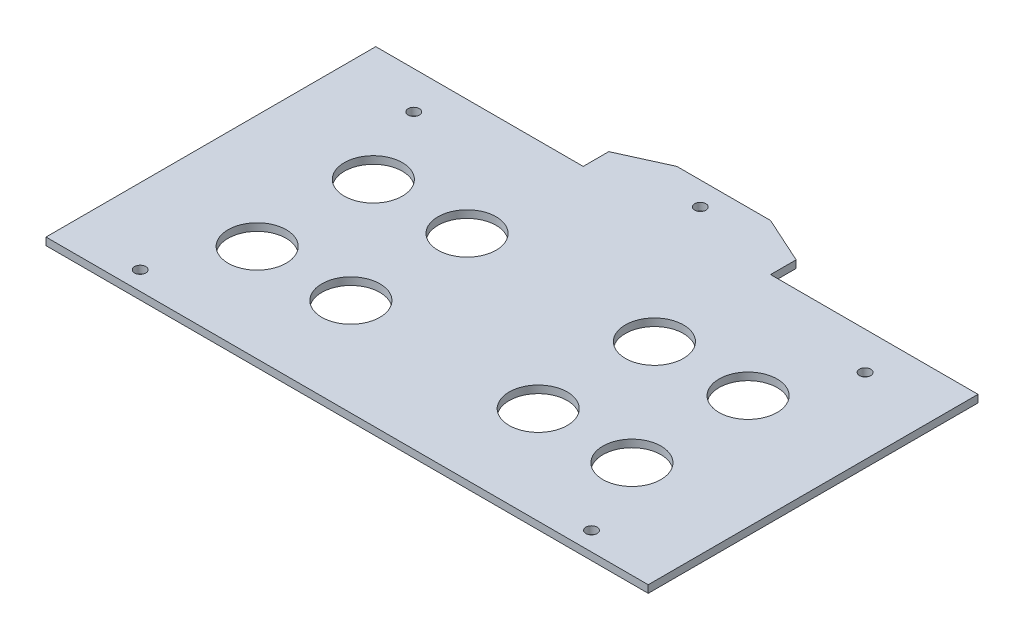
ISO-10303-21;
HEADER;
FILE_DESCRIPTION(('STEP AP214'),'2;1');
FILE_NAME('part.step','',(''),(''),'','','');
FILE_SCHEMA(('AUTOMOTIVE_DESIGN { 1 0 10303 214 1 1 1 1 }'));
ENDSEC;
DATA;
#1=APPLICATION_CONTEXT('core data for automotive mechanical design processes');
#2=APPLICATION_PROTOCOL_DEFINITION('international standard','automotive_design',2000,#1);
#3=PRODUCT_CONTEXT('',#1,'mechanical');
#4=PRODUCT('Part','Part','',(#3));
#5=PRODUCT_RELATED_PRODUCT_CATEGORY('part','',(#4));
#6=PRODUCT_DEFINITION_FORMATION('','',#4);
#7=PRODUCT_DEFINITION_CONTEXT('part definition',#1,'design');
#8=PRODUCT_DEFINITION('design','',#6,#7);
#9=PRODUCT_DEFINITION_SHAPE('','',#8);
#10=(LENGTH_UNIT() NAMED_UNIT(*) SI_UNIT(.MILLI.,.METRE.));
#11=(NAMED_UNIT(*) PLANE_ANGLE_UNIT() SI_UNIT($,.RADIAN.));
#12=(NAMED_UNIT(*) SI_UNIT($,.STERADIAN.) SOLID_ANGLE_UNIT());
#13=UNCERTAINTY_MEASURE_WITH_UNIT(LENGTH_MEASURE(1.E-05),#10,'distance_accuracy_value','');
#14=(GEOMETRIC_REPRESENTATION_CONTEXT(3) GLOBAL_UNCERTAINTY_ASSIGNED_CONTEXT((#13)) GLOBAL_UNIT_ASSIGNED_CONTEXT((#10,
#11,#12)) REPRESENTATION_CONTEXT('',''));
#15=CARTESIAN_POINT('',(0.,0.,0.));
#16=DIRECTION('',(0.,0.,1.));
#17=DIRECTION('',(1.,0.,0.));
#18=AXIS2_PLACEMENT_3D('',#15,#16,#17);
#19=CARTESIAN_POINT('',(0.,2.,-44.));
#20=DIRECTION('',(0.,0.,1.));
#21=DIRECTION('',(1.,0.,0.));
#22=AXIS2_PLACEMENT_3D('',#19,#20,#21);
#23=PLANE('',#22);
#24=DIRECTION('',(-1.,0.,0.));
#25=VECTOR('',#24,1.);
#26=CARTESIAN_POINT('',(0.,0.,-44.));
#27=LINE('',#26,#25);
#28=CARTESIAN_POINT('',(-23.8283042472908,0.,-44.));
#29=VERTEX_POINT('',#28);
#30=CARTESIAN_POINT('',(-79.1797078460986,0.,-44.));
#31=VERTEX_POINT('',#30);
#32=EDGE_CURVE('E158',#29,#31,#27,.T.);
#33=ORIENTED_EDGE('',*,*,#32,.T.);
#34=DIRECTION('',(0.,1.,0.));
#35=VECTOR('',#34,1.);
#36=CARTESIAN_POINT('',(-79.1797078460986,-8.,-44.));
#37=LINE('',#36,#35);
#38=CARTESIAN_POINT('',(-79.1797078460986,2.,-44.));
#39=VERTEX_POINT('',#38);
#40=EDGE_CURVE('E59',#31,#39,#37,.T.);
#41=ORIENTED_EDGE('',*,*,#40,.T.);
#42=DIRECTION('',(-1.,0.,0.));
#43=VECTOR('',#42,1.);
#44=CARTESIAN_POINT('',(0.,2.,-44.));
#45=LINE('',#44,#43);
#46=CARTESIAN_POINT('',(-23.8283042472908,2.,-44.));
#47=VERTEX_POINT('',#46);
#48=EDGE_CURVE('E135',#47,#39,#45,.T.);
#49=ORIENTED_EDGE('',*,*,#48,.F.);
#50=DIRECTION('',(0.,1.,0.));
#51=VECTOR('',#50,1.);
#52=CARTESIAN_POINT('',(-23.8283042472908,-51.537589944117,-44.));
#53=LINE('',#52,#51);
#54=EDGE_CURVE('E243',#29,#47,#53,.T.);
#55=ORIENTED_EDGE('',*,*,#54,.F.);
#56=EDGE_LOOP('',(#33,#41,#49,#55));
#57=FACE_BOUND('',#56,.T.);
#58=ADVANCED_FACE('F44',(#57),#23,.F.);
#59=CARTESIAN_POINT('',(81.523099351517,2.,-44.));
#60=VERTEX_POINT('',#59);
#61=CARTESIAN_POINT('',(26.1716957527092,2.,-44.));
#62=VERTEX_POINT('',#61);
#63=EDGE_CURVE('E139',#60,#62,#45,.T.);
#64=ORIENTED_EDGE('',*,*,#63,.F.);
#65=DIRECTION('',(0.,1.,0.));
#66=VECTOR('',#65,1.);
#67=CARTESIAN_POINT('',(81.523099351517,-8.,-44.));
#68=LINE('',#67,#66);
#69=CARTESIAN_POINT('',(81.523099351517,0.,-44.));
#70=VERTEX_POINT('',#69);
#71=EDGE_CURVE('E203',#70,#60,#68,.T.);
#72=ORIENTED_EDGE('',*,*,#71,.F.);
#73=CARTESIAN_POINT('',(26.1716957527092,0.,-44.));
#74=VERTEX_POINT('',#73);
#75=EDGE_CURVE('E155',#70,#74,#27,.T.);
#76=ORIENTED_EDGE('',*,*,#75,.T.);
#77=DIRECTION('',(0.,1.,0.));
#78=VECTOR('',#77,1.);
#79=CARTESIAN_POINT('',(26.1716957527092,-51.537589944117,-44.));
#80=LINE('',#79,#78);
#81=EDGE_CURVE('E219',#74,#62,#80,.T.);
#82=ORIENTED_EDGE('',*,*,#81,.T.);
#83=EDGE_LOOP('',(#64,#72,#76,#82));
#84=FACE_BOUND('',#83,.T.);
#85=ADVANCED_FACE('F46',(#84),#23,.F.);
#86=CARTESIAN_POINT('',(-59.0420655328614,2.,-34.));
#87=DIRECTION('',(0.,-1.,0.));
#88=DIRECTION('',(0.,0.,-1.));
#89=AXIS2_PLACEMENT_3D('',#86,#87,#88);
#90=CYLINDRICAL_SURFACE('',#89,1.5);
#91=CARTESIAN_POINT('',(-59.0420655328614,2.,-34.));
#92=DIRECTION('',(0.,1.,0.));
#93=DIRECTION('',(0.,0.,1.));
#94=AXIS2_PLACEMENT_3D('',#91,#92,#93);
#95=CIRCLE('',#94,1.5);
#96=CARTESIAN_POINT('',(-59.0420655328614,2.,-32.5));
#97=VERTEX_POINT('',#96);
#98=EDGE_CURVE('E149',#97,#97,#95,.T.);
#99=ORIENTED_EDGE('',*,*,#98,.T.);
#100=EDGE_LOOP('',(#99));
#101=FACE_BOUND('',#100,.T.);
#102=CARTESIAN_POINT('',(-59.0420655328614,0.,-34.));
#103=DIRECTION('',(0.,1.,0.));
#104=DIRECTION('',(0.,0.,1.));
#105=AXIS2_PLACEMENT_3D('',#102,#103,#104);
#106=CIRCLE('',#105,1.5);
#107=CARTESIAN_POINT('',(-59.0420655328614,0.,-32.5));
#108=VERTEX_POINT('',#107);
#109=EDGE_CURVE('E166',#108,#108,#106,.T.);
#110=ORIENTED_EDGE('',*,*,#109,.F.);
#111=EDGE_LOOP('',(#110));
#112=FACE_BOUND('',#111,.T.);
#113=ADVANCED_FACE('F314',(#101,#112),#90,.F.);
#114=CARTESIAN_POINT('',(-59.0420655328614,2.,39.));
#115=DIRECTION('',(0.,-1.,0.));
#116=DIRECTION('',(0.,0.,-1.));
#117=AXIS2_PLACEMENT_3D('',#114,#115,#116);
#118=CYLINDRICAL_SURFACE('',#117,1.5);
#119=CARTESIAN_POINT('',(-59.0420655328614,2.,39.));
#120=DIRECTION('',(0.,1.,0.));
#121=DIRECTION('',(0.,0.,1.));
#122=AXIS2_PLACEMENT_3D('',#119,#120,#121);
#123=CIRCLE('',#122,1.5);
#124=CARTESIAN_POINT('',(-59.0420655328614,2.,40.5));
#125=VERTEX_POINT('',#124);
#126=EDGE_CURVE('E142',#125,#125,#123,.T.);
#127=ORIENTED_EDGE('',*,*,#126,.T.);
#128=EDGE_LOOP('',(#127));
#129=FACE_BOUND('',#128,.T.);
#130=CARTESIAN_POINT('',(-59.0420655328614,0.,39.));
#131=DIRECTION('',(0.,1.,0.));
#132=DIRECTION('',(0.,0.,1.));
#133=AXIS2_PLACEMENT_3D('',#130,#131,#132);
#134=CIRCLE('',#133,1.5);
#135=CARTESIAN_POINT('',(-59.0420655328614,0.,40.5));
#136=VERTEX_POINT('',#135);
#137=EDGE_CURVE('E163',#136,#136,#134,.T.);
#138=ORIENTED_EDGE('',*,*,#137,.F.);
#139=EDGE_LOOP('',(#138));
#140=FACE_BOUND('',#139,.T.);
#141=ADVANCED_FACE('F385',(#129,#140),#118,.F.);
#142=CARTESIAN_POINT('',(61.3854570382798,2.,39.));
#143=DIRECTION('',(0.,-1.,0.));
#144=DIRECTION('',(0.,0.,-1.));
#145=AXIS2_PLACEMENT_3D('',#142,#143,#144);
#146=CYLINDRICAL_SURFACE('',#145,1.5);
#147=CARTESIAN_POINT('',(61.3854570382798,2.,39.));
#148=DIRECTION('',(0.,1.,0.));
#149=DIRECTION('',(0.,0.,1.));
#150=AXIS2_PLACEMENT_3D('',#147,#148,#149);
#151=CIRCLE('',#150,1.5);
#152=CARTESIAN_POINT('',(61.3854570382798,2.,40.5));
#153=VERTEX_POINT('',#152);
#154=EDGE_CURVE('E138',#153,#153,#151,.T.);
#155=ORIENTED_EDGE('',*,*,#154,.T.);
#156=EDGE_LOOP('',(#155));
#157=FACE_BOUND('',#156,.T.);
#158=CARTESIAN_POINT('',(61.3854570382798,0.,39.));
#159=DIRECTION('',(0.,1.,0.));
#160=DIRECTION('',(0.,0.,1.));
#161=AXIS2_PLACEMENT_3D('',#158,#159,#160);
#162=CIRCLE('',#161,1.5);
#163=CARTESIAN_POINT('',(61.3854570382798,0.,40.5));
#164=VERTEX_POINT('',#163);
#165=EDGE_CURVE('E160',#164,#164,#162,.T.);
#166=ORIENTED_EDGE('',*,*,#165,.F.);
#167=EDGE_LOOP('',(#166));
#168=FACE_BOUND('',#167,.T.);
#169=ADVANCED_FACE('F389',(#157,#168),#146,.F.);
#170=CARTESIAN_POINT('',(0.,2.,44.));
#171=DIRECTION('',(0.,0.,-1.));
#172=DIRECTION('',(-1.,0.,0.));
#173=AXIS2_PLACEMENT_3D('',#170,#171,#172);
#174=PLANE('',#173);
#175=DIRECTION('',(1.,0.,0.));
#176=VECTOR('',#175,1.);
#177=CARTESIAN_POINT('',(0.,2.,44.));
#178=LINE('',#177,#176);
#179=CARTESIAN_POINT('',(-79.1797078460986,2.,44.));
#180=VERTEX_POINT('',#179);
#181=CARTESIAN_POINT('',(81.523099351517,2.,44.));
#182=VERTEX_POINT('',#181);
#183=EDGE_CURVE('E133',#180,#182,#178,.T.);
#184=ORIENTED_EDGE('',*,*,#183,.F.);
#185=DIRECTION('',(0.,1.,0.));
#186=VECTOR('',#185,1.);
#187=CARTESIAN_POINT('',(-79.1797078460986,-8.,44.));
#188=LINE('',#187,#186);
#189=CARTESIAN_POINT('',(-79.1797078460986,0.,44.));
#190=VERTEX_POINT('',#189);
#191=EDGE_CURVE('E118',#190,#180,#188,.T.);
#192=ORIENTED_EDGE('',*,*,#191,.F.);
#193=DIRECTION('',(1.,0.,0.));
#194=VECTOR('',#193,1.);
#195=CARTESIAN_POINT('',(0.,0.,44.));
#196=LINE('',#195,#194);
#197=CARTESIAN_POINT('',(81.523099351517,0.,44.));
#198=VERTEX_POINT('',#197);
#199=EDGE_CURVE('E157',#190,#198,#196,.T.);
#200=ORIENTED_EDGE('',*,*,#199,.T.);
#201=DIRECTION('',(0.,1.,0.));
#202=VECTOR('',#201,1.);
#203=CARTESIAN_POINT('',(81.523099351517,-8.,44.));
#204=LINE('',#203,#202);
#205=EDGE_CURVE('E66',#198,#182,#204,.T.);
#206=ORIENTED_EDGE('',*,*,#205,.T.);
#207=EDGE_LOOP('',(#184,#192,#200,#206));
#208=FACE_BOUND('',#207,.T.);
#209=ADVANCED_FACE('F137',(#208),#174,.F.);
#210=CARTESIAN_POINT('',(61.3854570382798,2.,-34.));
#211=DIRECTION('',(0.,-1.,0.));
#212=DIRECTION('',(0.,0.,-1.));
#213=AXIS2_PLACEMENT_3D('',#210,#211,#212);
#214=CYLINDRICAL_SURFACE('',#213,1.5);
#215=CARTESIAN_POINT('',(61.3854570382798,2.,-34.));
#216=DIRECTION('',(0.,1.,0.));
#217=DIRECTION('',(0.,0.,1.));
#218=AXIS2_PLACEMENT_3D('',#215,#216,#217);
#219=CIRCLE('',#218,1.5);
#220=CARTESIAN_POINT('',(61.3854570382798,2.,-32.5));
#221=VERTEX_POINT('',#220);
#222=EDGE_CURVE('E152',#221,#221,#219,.T.);
#223=ORIENTED_EDGE('',*,*,#222,.T.);
#224=EDGE_LOOP('',(#223));
#225=FACE_BOUND('',#224,.T.);
#226=CARTESIAN_POINT('',(61.3854570382798,0.,-34.));
#227=DIRECTION('',(0.,1.,0.));
#228=DIRECTION('',(0.,0.,1.));
#229=AXIS2_PLACEMENT_3D('',#226,#227,#228);
#230=CIRCLE('',#229,1.5);
#231=CARTESIAN_POINT('',(61.3854570382798,0.,-32.5));
#232=VERTEX_POINT('',#231);
#233=EDGE_CURVE('E169',#232,#232,#230,.T.);
#234=ORIENTED_EDGE('',*,*,#233,.F.);
#235=EDGE_LOOP('',(#234));
#236=FACE_BOUND('',#235,.T.);
#237=ADVANCED_FACE('F283',(#225,#236),#214,.F.);
#238=CARTESIAN_POINT('',(0.,2.,0.));
#239=DIRECTION('',(0.,1.,0.));
#240=DIRECTION('',(0.,0.,1.));
#241=AXIS2_PLACEMENT_3D('',#238,#239,#240);
#242=PLANE('',#241);
#243=DIRECTION('',(0.,0.,-1.));
#244=VECTOR('',#243,1.);
#245=CARTESIAN_POINT('',(-79.1797078460986,2.,-44.));
#246=LINE('',#245,#244);
#247=EDGE_CURVE('E121',#180,#39,#246,.T.);
#248=ORIENTED_EDGE('',*,*,#247,.F.);
#249=ORIENTED_EDGE('',*,*,#183,.T.);
#250=DIRECTION('',(0.,0.,1.));
#251=VECTOR('',#250,1.);
#252=CARTESIAN_POINT('',(81.523099351517,2.,-44.));
#253=LINE('',#252,#251);
#254=EDGE_CURVE('E207',#60,#182,#253,.T.);
#255=ORIENTED_EDGE('',*,*,#254,.F.);
#256=ORIENTED_EDGE('',*,*,#63,.T.);
#257=DIRECTION('',(0.,0.,-1.));
#258=VECTOR('',#257,1.);
#259=CARTESIAN_POINT('',(26.1716957527092,2.,-44.));
#260=LINE('',#259,#258);
#261=CARTESIAN_POINT('',(26.1716957527092,2.,-50.823606938333));
#262=VERTEX_POINT('',#261);
#263=EDGE_CURVE('E227',#62,#262,#260,.T.);
#264=ORIENTED_EDGE('',*,*,#263,.T.);
#265=DIRECTION('',(-0.910654396943774,0.,-0.41316893557838));
#266=VECTOR('',#265,1.);
#267=CARTESIAN_POINT('',(26.1716957527092,2.,-50.823606938333));
#268=LINE('',#267,#266);
#269=CARTESIAN_POINT('',(13.6716957527092,2.,-56.4949260601234));
#270=VERTEX_POINT('',#269);
#271=EDGE_CURVE('E230',#262,#270,#268,.T.);
#272=ORIENTED_EDGE('',*,*,#271,.T.);
#273=DIRECTION('',(-1.,0.,0.));
#274=VECTOR('',#273,1.);
#275=CARTESIAN_POINT('',(13.6716957527092,2.,-56.4949260601234));
#276=LINE('',#275,#274);
#277=CARTESIAN_POINT('',(-11.3283042472908,2.,-56.4949260601234));
#278=VERTEX_POINT('',#277);
#279=EDGE_CURVE('E233',#270,#278,#276,.T.);
#280=ORIENTED_EDGE('',*,*,#279,.T.);
#281=DIRECTION('',(-0.910654396943774,0.,0.41316893557838));
#282=VECTOR('',#281,1.);
#283=CARTESIAN_POINT('',(-11.3283042472908,2.,-56.4949260601234));
#284=LINE('',#283,#282);
#285=CARTESIAN_POINT('',(-23.8283042472908,2.,-50.823606938333));
#286=VERTEX_POINT('',#285);
#287=EDGE_CURVE('E236',#278,#286,#284,.T.);
#288=ORIENTED_EDGE('',*,*,#287,.T.);
#289=DIRECTION('',(0.,0.,1.));
#290=VECTOR('',#289,1.);
#291=CARTESIAN_POINT('',(-23.8283042472908,2.,-50.823606938333));
#292=LINE('',#291,#290);
#293=EDGE_CURVE('E239',#286,#47,#292,.T.);
#294=ORIENTED_EDGE('',*,*,#293,.T.);
#295=ORIENTED_EDGE('',*,*,#48,.T.);
#296=EDGE_LOOP('',(#248,#249,#255,#256,#264,#272,#280,#288,#294,#295));
#297=FACE_BOUND('',#296,.T.);
#298=CARTESIAN_POINT('',(-23.8283042472908,2.,18.0000000000002));
#299=DIRECTION('',(0.,1.,0.));
#300=DIRECTION('',(0.,0.,-1.));
#301=AXIS2_PLACEMENT_3D('',#298,#299,#300);
#302=CIRCLE('',#301,7.75);
#303=CARTESIAN_POINT('',(-23.8283042472908,2.,10.2500000000002));
#304=VERTEX_POINT('',#303);
#305=EDGE_CURVE('E268',#304,#304,#302,.T.);
#306=ORIENTED_EDGE('',*,*,#305,.F.);
#307=EDGE_LOOP('',(#306));
#308=FACE_BOUND('',#307,.T.);
#309=CARTESIAN_POINT('',(51.1716957527092,2.,18.0000000000004));
#310=DIRECTION('',(0.,1.,0.));
#311=DIRECTION('',(0.,0.,-1.));
#312=AXIS2_PLACEMENT_3D('',#309,#310,#311);
#313=CIRCLE('',#312,7.75);
#314=CARTESIAN_POINT('',(51.1716957527092,2.,10.2500000000004));
#315=VERTEX_POINT('',#314);
#316=EDGE_CURVE('E271',#315,#315,#313,.T.);
#317=ORIENTED_EDGE('',*,*,#316,.F.);
#318=EDGE_LOOP('',(#317));
#319=FACE_BOUND('',#318,.T.);
#320=CARTESIAN_POINT('',(26.1716957527092,2.,18.0000000000004));
#321=DIRECTION('',(0.,1.,0.));
#322=DIRECTION('',(0.,0.,-1.));
#323=AXIS2_PLACEMENT_3D('',#320,#321,#322);
#324=CIRCLE('',#323,7.75);
#325=CARTESIAN_POINT('',(26.1716957527092,2.,10.2500000000004));
#326=VERTEX_POINT('',#325);
#327=EDGE_CURVE('E255',#326,#326,#324,.T.);
#328=ORIENTED_EDGE('',*,*,#327,.F.);
#329=EDGE_LOOP('',(#328));
#330=FACE_BOUND('',#329,.T.);
#331=CARTESIAN_POINT('',(-48.8283042472908,2.,-13.));
#332=DIRECTION('',(0.,1.,0.));
#333=DIRECTION('',(0.,0.,1.));
#334=AXIS2_PLACEMENT_3D('',#331,#332,#333);
#335=CIRCLE('',#334,7.75);
#336=CARTESIAN_POINT('',(-48.8283042472908,2.,-5.25));
#337=VERTEX_POINT('',#336);
#338=EDGE_CURVE('E265',#337,#337,#335,.T.);
#339=ORIENTED_EDGE('',*,*,#338,.F.);
#340=EDGE_LOOP('',(#339));
#341=FACE_BOUND('',#340,.T.);
#342=CARTESIAN_POINT('',(-23.8283042472908,2.,-13.0000000000002));
#343=DIRECTION('',(0.,1.,0.));
#344=DIRECTION('',(0.,0.,1.));
#345=AXIS2_PLACEMENT_3D('',#342,#343,#344);
#346=CIRCLE('',#345,7.75);
#347=CARTESIAN_POINT('',(-23.8283042472908,2.,-5.25000000000018));
#348=VERTEX_POINT('',#347);
#349=EDGE_CURVE('E262',#348,#348,#346,.T.);
#350=ORIENTED_EDGE('',*,*,#349,.F.);
#351=EDGE_LOOP('',(#350));
#352=FACE_BOUND('',#351,.T.);
#353=CARTESIAN_POINT('',(51.1716957527092,2.,-13.0000000000003));
#354=DIRECTION('',(0.,1.,0.));
#355=DIRECTION('',(0.,0.,1.));
#356=AXIS2_PLACEMENT_3D('',#353,#354,#355);
#357=CIRCLE('',#356,7.75);
#358=CARTESIAN_POINT('',(51.1716957527092,2.,-5.25000000000035));
#359=VERTEX_POINT('',#358);
#360=EDGE_CURVE('E259',#359,#359,#357,.T.);
#361=ORIENTED_EDGE('',*,*,#360,.F.);
#362=EDGE_LOOP('',(#361));
#363=FACE_BOUND('',#362,.T.);
#364=CARTESIAN_POINT('',(26.1716957527092,2.,-13.0000000000003));
#365=DIRECTION('',(0.,1.,0.));
#366=DIRECTION('',(0.,0.,1.));
#367=AXIS2_PLACEMENT_3D('',#364,#365,#366);
#368=CIRCLE('',#367,7.75);
#369=CARTESIAN_POINT('',(26.1716957527092,2.,-5.25000000000035));
#370=VERTEX_POINT('',#369);
#371=EDGE_CURVE('E256',#370,#370,#368,.T.);
#372=ORIENTED_EDGE('',*,*,#371,.F.);
#373=EDGE_LOOP('',(#372));
#374=FACE_BOUND('',#373,.T.);
#375=CARTESIAN_POINT('',(-48.8283042472908,2.,18.));
#376=DIRECTION('',(0.,1.,0.));
#377=DIRECTION('',(0.,0.,-1.));
#378=AXIS2_PLACEMENT_3D('',#375,#376,#377);
#379=CIRCLE('',#378,7.75);
#380=CARTESIAN_POINT('',(-48.8283042472908,2.,10.25));
#381=VERTEX_POINT('',#380);
#382=EDGE_CURVE('E176',#381,#381,#379,.T.);
#383=ORIENTED_EDGE('',*,*,#382,.F.);
#384=EDGE_LOOP('',(#383));
#385=FACE_BOUND('',#384,.T.);
#386=ORIENTED_EDGE('',*,*,#154,.F.);
#387=EDGE_LOOP('',(#386));
#388=FACE_BOUND('',#387,.T.);
#389=ORIENTED_EDGE('',*,*,#126,.F.);
#390=EDGE_LOOP('',(#389));
#391=FACE_BOUND('',#390,.T.);
#392=ORIENTED_EDGE('',*,*,#98,.F.);
#393=EDGE_LOOP('',(#392));
#394=FACE_BOUND('',#393,.T.);
#395=ORIENTED_EDGE('',*,*,#222,.F.);
#396=EDGE_LOOP('',(#395));
#397=FACE_BOUND('',#396,.T.);
#398=CARTESIAN_POINT('',(1.1716957527092,2.,-50.2474630300617));
#399=DIRECTION('',(0.,1.,0.));
#400=DIRECTION('',(0.,0.,1.));
#401=AXIS2_PLACEMENT_3D('',#398,#399,#400);
#402=CIRCLE('',#401,1.5);
#403=CARTESIAN_POINT('',(1.1716957527092,2.,-48.7474630300617));
#404=VERTEX_POINT('',#403);
#405=EDGE_CURVE('E224',#404,#404,#402,.T.);
#406=ORIENTED_EDGE('',*,*,#405,.F.);
#407=EDGE_LOOP('',(#406));
#408=FACE_BOUND('',#407,.T.);
#409=ADVANCED_FACE('F130',(#297,#308,#319,#330,#341,#352,#363,#374,#385,#388,#391,#394,#397,
#408),#242,.T.);
#410=CARTESIAN_POINT('',(0.,0.,0.));
#411=DIRECTION('',(0.,1.,0.));
#412=DIRECTION('',(0.,0.,1.));
#413=AXIS2_PLACEMENT_3D('',#410,#411,#412);
#414=PLANE('',#413);
#415=CARTESIAN_POINT('',(-23.8283042472908,0.,18.0000000000002));
#416=DIRECTION('',(0.,1.,0.));
#417=DIRECTION('',(0.,0.,1.));
#418=AXIS2_PLACEMENT_3D('',#415,#416,#417);
#419=CIRCLE('',#418,7.75);
#420=CARTESIAN_POINT('',(-23.8283042472908,0.,25.7500000000002));
#421=VERTEX_POINT('',#420);
#422=EDGE_CURVE('E194',#421,#421,#419,.T.);
#423=ORIENTED_EDGE('',*,*,#422,.T.);
#424=EDGE_LOOP('',(#423));
#425=FACE_BOUND('',#424,.T.);
#426=CARTESIAN_POINT('',(51.1716957527092,0.,18.0000000000004));
#427=DIRECTION('',(0.,1.,0.));
#428=DIRECTION('',(0.,0.,1.));
#429=AXIS2_PLACEMENT_3D('',#426,#427,#428);
#430=CIRCLE('',#429,7.75);
#431=CARTESIAN_POINT('',(51.1716957527092,0.,25.7500000000004));
#432=VERTEX_POINT('',#431);
#433=EDGE_CURVE('E191',#432,#432,#430,.T.);
#434=ORIENTED_EDGE('',*,*,#433,.T.);
#435=EDGE_LOOP('',(#434));
#436=FACE_BOUND('',#435,.T.);
#437=CARTESIAN_POINT('',(26.1716957527092,0.,18.0000000000004));
#438=DIRECTION('',(0.,1.,0.));
#439=DIRECTION('',(0.,0.,1.));
#440=AXIS2_PLACEMENT_3D('',#437,#438,#439);
#441=CIRCLE('',#440,7.75);
#442=CARTESIAN_POINT('',(26.1716957527092,0.,25.7500000000004));
#443=VERTEX_POINT('',#442);
#444=EDGE_CURVE('E188',#443,#443,#441,.T.);
#445=ORIENTED_EDGE('',*,*,#444,.T.);
#446=EDGE_LOOP('',(#445));
#447=FACE_BOUND('',#446,.T.);
#448=CARTESIAN_POINT('',(-48.8283042472908,0.,-13.));
#449=DIRECTION('',(0.,1.,0.));
#450=DIRECTION('',(0.,0.,1.));
#451=AXIS2_PLACEMENT_3D('',#448,#449,#450);
#452=CIRCLE('',#451,7.75);
#453=CARTESIAN_POINT('',(-48.8283042472908,0.,-5.25));
#454=VERTEX_POINT('',#453);
#455=EDGE_CURVE('E185',#454,#454,#452,.T.);
#456=ORIENTED_EDGE('',*,*,#455,.T.);
#457=EDGE_LOOP('',(#456));
#458=FACE_BOUND('',#457,.T.);
#459=CARTESIAN_POINT('',(-23.8283042472908,0.,-13.0000000000002));
#460=DIRECTION('',(0.,1.,0.));
#461=DIRECTION('',(0.,0.,1.));
#462=AXIS2_PLACEMENT_3D('',#459,#460,#461);
#463=CIRCLE('',#462,7.75);
#464=CARTESIAN_POINT('',(-23.8283042472908,0.,-5.25000000000018));
#465=VERTEX_POINT('',#464);
#466=EDGE_CURVE('E182',#465,#465,#463,.T.);
#467=ORIENTED_EDGE('',*,*,#466,.T.);
#468=EDGE_LOOP('',(#467));
#469=FACE_BOUND('',#468,.T.);
#470=CARTESIAN_POINT('',(51.1716957527092,0.,-13.0000000000003));
#471=DIRECTION('',(0.,1.,0.));
#472=DIRECTION('',(0.,0.,1.));
#473=AXIS2_PLACEMENT_3D('',#470,#471,#472);
#474=CIRCLE('',#473,7.75);
#475=CARTESIAN_POINT('',(51.1716957527092,0.,-5.25000000000035));
#476=VERTEX_POINT('',#475);
#477=EDGE_CURVE('E179',#476,#476,#474,.T.);
#478=ORIENTED_EDGE('',*,*,#477,.T.);
#479=EDGE_LOOP('',(#478));
#480=FACE_BOUND('',#479,.T.);
#481=CARTESIAN_POINT('',(26.1716957527092,0.,-13.0000000000003));
#482=DIRECTION('',(0.,1.,0.));
#483=DIRECTION('',(0.,0.,1.));
#484=AXIS2_PLACEMENT_3D('',#481,#482,#483);
#485=CIRCLE('',#484,7.75);
#486=CARTESIAN_POINT('',(26.1716957527092,0.,-5.25000000000035));
#487=VERTEX_POINT('',#486);
#488=EDGE_CURVE('E175',#487,#487,#485,.T.);
#489=ORIENTED_EDGE('',*,*,#488,.T.);
#490=EDGE_LOOP('',(#489));
#491=FACE_BOUND('',#490,.T.);
#492=CARTESIAN_POINT('',(-48.8283042472908,0.,18.));
#493=DIRECTION('',(0.,1.,0.));
#494=DIRECTION('',(0.,0.,1.));
#495=AXIS2_PLACEMENT_3D('',#492,#493,#494);
#496=CIRCLE('',#495,7.75);
#497=CARTESIAN_POINT('',(-48.8283042472908,0.,25.75));
#498=VERTEX_POINT('',#497);
#499=EDGE_CURVE('E172',#498,#498,#496,.T.);
#500=ORIENTED_EDGE('',*,*,#499,.T.);
#501=EDGE_LOOP('',(#500));
#502=FACE_BOUND('',#501,.T.);
#503=ORIENTED_EDGE('',*,*,#199,.F.);
#504=DIRECTION('',(0.,0.,-1.));
#505=VECTOR('',#504,1.);
#506=CARTESIAN_POINT('',(-79.1797078460986,0.,0.));
#507=LINE('',#506,#505);
#508=EDGE_CURVE('E11',#190,#31,#507,.T.);
#509=ORIENTED_EDGE('',*,*,#508,.T.);
#510=ORIENTED_EDGE('',*,*,#32,.F.);
#511=DIRECTION('',(0.,0.,-1.));
#512=VECTOR('',#511,1.);
#513=CARTESIAN_POINT('',(-23.8283042472908,0.,-50.823606938333));
#514=LINE('',#513,#512);
#515=CARTESIAN_POINT('',(-23.8283042472908,0.,-50.823606938333));
#516=VERTEX_POINT('',#515);
#517=EDGE_CURVE('E221',#29,#516,#514,.T.);
#518=ORIENTED_EDGE('',*,*,#517,.T.);
#519=DIRECTION('',(0.910654396943774,0.,-0.41316893557838));
#520=VECTOR('',#519,1.);
#521=CARTESIAN_POINT('',(-11.3283042472908,0.,-56.4949260601234));
#522=LINE('',#521,#520);
#523=CARTESIAN_POINT('',(-11.3283042472908,0.,-56.4949260601234));
#524=VERTEX_POINT('',#523);
#525=EDGE_CURVE('E218',#516,#524,#522,.T.);
#526=ORIENTED_EDGE('',*,*,#525,.T.);
#527=DIRECTION('',(1.,0.,0.));
#528=VECTOR('',#527,1.);
#529=CARTESIAN_POINT('',(13.6716957527092,0.,-56.4949260601234));
#530=LINE('',#529,#528);
#531=CARTESIAN_POINT('',(13.6716957527092,0.,-56.4949260601234));
#532=VERTEX_POINT('',#531);
#533=EDGE_CURVE('E216',#524,#532,#530,.T.);
#534=ORIENTED_EDGE('',*,*,#533,.T.);
#535=DIRECTION('',(0.910654396943774,0.,0.41316893557838));
#536=VECTOR('',#535,1.);
#537=CARTESIAN_POINT('',(26.1716957527092,0.,-50.823606938333));
#538=LINE('',#537,#536);
#539=CARTESIAN_POINT('',(26.1716957527092,0.,-50.823606938333));
#540=VERTEX_POINT('',#539);
#541=EDGE_CURVE('E212',#532,#540,#538,.T.);
#542=ORIENTED_EDGE('',*,*,#541,.T.);
#543=DIRECTION('',(0.,0.,1.));
#544=VECTOR('',#543,1.);
#545=CARTESIAN_POINT('',(26.1716957527092,0.,-44.));
#546=LINE('',#545,#544);
#547=EDGE_CURVE('E215',#540,#74,#546,.T.);
#548=ORIENTED_EDGE('',*,*,#547,.T.);
#549=ORIENTED_EDGE('',*,*,#75,.F.);
#550=DIRECTION('',(0.,0.,1.));
#551=VECTOR('',#550,1.);
#552=CARTESIAN_POINT('',(81.523099351517,0.,0.));
#553=LINE('',#552,#551);
#554=EDGE_CURVE('E52',#70,#198,#553,.T.);
#555=ORIENTED_EDGE('',*,*,#554,.T.);
#556=EDGE_LOOP('',(#503,#509,#510,#518,#526,#534,#542,#548,#549,#555));
#557=FACE_BOUND('',#556,.T.);
#558=ORIENTED_EDGE('',*,*,#165,.T.);
#559=EDGE_LOOP('',(#558));
#560=FACE_BOUND('',#559,.T.);
#561=ORIENTED_EDGE('',*,*,#137,.T.);
#562=EDGE_LOOP('',(#561));
#563=FACE_BOUND('',#562,.T.);
#564=ORIENTED_EDGE('',*,*,#109,.T.);
#565=EDGE_LOOP('',(#564));
#566=FACE_BOUND('',#565,.T.);
#567=ORIENTED_EDGE('',*,*,#233,.T.);
#568=EDGE_LOOP('',(#567));
#569=FACE_BOUND('',#568,.T.);
#570=CARTESIAN_POINT('',(1.1716957527092,0.,-50.2474630300617));
#571=DIRECTION('',(0.,1.,0.));
#572=DIRECTION('',(0.,0.,1.));
#573=AXIS2_PLACEMENT_3D('',#570,#571,#572);
#574=CIRCLE('',#573,1.5);
#575=CARTESIAN_POINT('',(1.1716957527092,0.,-48.7474630300617));
#576=VERTEX_POINT('',#575);
#577=EDGE_CURVE('E214',#576,#576,#574,.F.);
#578=ORIENTED_EDGE('',*,*,#577,.F.);
#579=EDGE_LOOP('',(#578));
#580=FACE_BOUND('',#579,.T.);
#581=ADVANCED_FACE('F198',(#425,#436,#447,#458,#469,#480,#491,#502,#557,#560,#563,#566,#569,
#580),#414,.F.);
#582=CARTESIAN_POINT('',(-48.8283042472908,-8.,18.));
#583=DIRECTION('',(0.,1.,0.));
#584=DIRECTION('',(0.,0.,1.));
#585=AXIS2_PLACEMENT_3D('',#582,#583,#584);
#586=CYLINDRICAL_SURFACE('',#585,7.75);
#587=ORIENTED_EDGE('',*,*,#382,.T.);
#588=EDGE_LOOP('',(#587));
#589=FACE_BOUND('',#588,.T.);
#590=ORIENTED_EDGE('',*,*,#499,.F.);
#591=EDGE_LOOP('',(#590));
#592=FACE_BOUND('',#591,.T.);
#593=ADVANCED_FACE('F278',(#589,#592),#586,.F.);
#594=CARTESIAN_POINT('',(26.1716957527092,-8.,-13.0000000000003));
#595=DIRECTION('',(0.,1.,0.));
#596=DIRECTION('',(0.,0.,1.));
#597=AXIS2_PLACEMENT_3D('',#594,#595,#596);
#598=CYLINDRICAL_SURFACE('',#597,7.75);
#599=ORIENTED_EDGE('',*,*,#371,.T.);
#600=EDGE_LOOP('',(#599));
#601=FACE_BOUND('',#600,.T.);
#602=ORIENTED_EDGE('',*,*,#488,.F.);
#603=EDGE_LOOP('',(#602));
#604=FACE_BOUND('',#603,.T.);
#605=ADVANCED_FACE('F352',(#601,#604),#598,.F.);
#606=CARTESIAN_POINT('',(51.1716957527092,-8.,-13.0000000000003));
#607=DIRECTION('',(0.,1.,0.));
#608=DIRECTION('',(0.,0.,1.));
#609=AXIS2_PLACEMENT_3D('',#606,#607,#608);
#610=CYLINDRICAL_SURFACE('',#609,7.75);
#611=ORIENTED_EDGE('',*,*,#360,.T.);
#612=EDGE_LOOP('',(#611));
#613=FACE_BOUND('',#612,.T.);
#614=ORIENTED_EDGE('',*,*,#477,.F.);
#615=EDGE_LOOP('',(#614));
#616=FACE_BOUND('',#615,.T.);
#617=ADVANCED_FACE('F355',(#613,#616),#610,.F.);
#618=CARTESIAN_POINT('',(-23.8283042472908,-8.,-13.0000000000002));
#619=DIRECTION('',(0.,1.,0.));
#620=DIRECTION('',(0.,0.,1.));
#621=AXIS2_PLACEMENT_3D('',#618,#619,#620);
#622=CYLINDRICAL_SURFACE('',#621,7.75);
#623=ORIENTED_EDGE('',*,*,#349,.T.);
#624=EDGE_LOOP('',(#623));
#625=FACE_BOUND('',#624,.T.);
#626=ORIENTED_EDGE('',*,*,#466,.F.);
#627=EDGE_LOOP('',(#626));
#628=FACE_BOUND('',#627,.T.);
#629=ADVANCED_FACE('F359',(#625,#628),#622,.F.);
#630=CARTESIAN_POINT('',(-48.8283042472908,-8.,-13.));
#631=DIRECTION('',(0.,1.,0.));
#632=DIRECTION('',(0.,0.,1.));
#633=AXIS2_PLACEMENT_3D('',#630,#631,#632);
#634=CYLINDRICAL_SURFACE('',#633,7.75);
#635=ORIENTED_EDGE('',*,*,#338,.T.);
#636=EDGE_LOOP('',(#635));
#637=FACE_BOUND('',#636,.T.);
#638=ORIENTED_EDGE('',*,*,#455,.F.);
#639=EDGE_LOOP('',(#638));
#640=FACE_BOUND('',#639,.T.);
#641=ADVANCED_FACE('F363',(#637,#640),#634,.F.);
#642=CARTESIAN_POINT('',(26.1716957527092,-8.,18.0000000000004));
#643=DIRECTION('',(0.,1.,0.));
#644=DIRECTION('',(0.,0.,1.));
#645=AXIS2_PLACEMENT_3D('',#642,#643,#644);
#646=CYLINDRICAL_SURFACE('',#645,7.75);
#647=ORIENTED_EDGE('',*,*,#327,.T.);
#648=EDGE_LOOP('',(#647));
#649=FACE_BOUND('',#648,.T.);
#650=ORIENTED_EDGE('',*,*,#444,.F.);
#651=EDGE_LOOP('',(#650));
#652=FACE_BOUND('',#651,.T.);
#653=ADVANCED_FACE('F367',(#649,#652),#646,.F.);
#654=CARTESIAN_POINT('',(51.1716957527092,-8.,18.0000000000004));
#655=DIRECTION('',(0.,1.,0.));
#656=DIRECTION('',(0.,0.,1.));
#657=AXIS2_PLACEMENT_3D('',#654,#655,#656);
#658=CYLINDRICAL_SURFACE('',#657,7.75);
#659=ORIENTED_EDGE('',*,*,#316,.T.);
#660=EDGE_LOOP('',(#659));
#661=FACE_BOUND('',#660,.T.);
#662=ORIENTED_EDGE('',*,*,#433,.F.);
#663=EDGE_LOOP('',(#662));
#664=FACE_BOUND('',#663,.T.);
#665=ADVANCED_FACE('F347',(#661,#664),#658,.F.);
#666=CARTESIAN_POINT('',(-23.8283042472908,-8.,18.0000000000002));
#667=DIRECTION('',(0.,1.,0.));
#668=DIRECTION('',(0.,0.,1.));
#669=AXIS2_PLACEMENT_3D('',#666,#667,#668);
#670=CYLINDRICAL_SURFACE('',#669,7.75);
#671=ORIENTED_EDGE('',*,*,#305,.T.);
#672=EDGE_LOOP('',(#671));
#673=FACE_BOUND('',#672,.T.);
#674=ORIENTED_EDGE('',*,*,#422,.F.);
#675=EDGE_LOOP('',(#674));
#676=FACE_BOUND('',#675,.T.);
#677=ADVANCED_FACE('F340',(#673,#676),#670,.F.);
#678=CARTESIAN_POINT('',(26.1716957527092,-51.537589944117,-50.823606938333));
#679=DIRECTION('',(0.41316893557838,0.,-0.910654396943774));
#680=DIRECTION('',(-0.910654396943774,0.,-0.41316893557838));
#681=AXIS2_PLACEMENT_3D('',#678,#679,#680);
#682=PLANE('',#681);
#683=ORIENTED_EDGE('',*,*,#541,.F.);
#684=DIRECTION('',(0.,1.,0.));
#685=VECTOR('',#684,1.);
#686=CARTESIAN_POINT('',(13.6716957527092,-51.537589944117,-56.4949260601234));
#687=LINE('',#686,#685);
#688=EDGE_CURVE('E250',#532,#270,#687,.T.);
#689=ORIENTED_EDGE('',*,*,#688,.T.);
#690=ORIENTED_EDGE('',*,*,#271,.F.);
#691=DIRECTION('',(0.,1.,0.));
#692=VECTOR('',#691,1.);
#693=CARTESIAN_POINT('',(26.1716957527092,-51.537589944117,-50.823606938333));
#694=LINE('',#693,#692);
#695=EDGE_CURVE('E241',#540,#262,#694,.T.);
#696=ORIENTED_EDGE('',*,*,#695,.F.);
#697=EDGE_LOOP('',(#683,#689,#690,#696));
#698=FACE_BOUND('',#697,.T.);
#699=ADVANCED_FACE('F335',(#698),#682,.T.);
#700=CARTESIAN_POINT('',(13.6716957527092,-51.537589944117,-56.4949260601234));
#701=DIRECTION('',(0.,0.,-1.));
#702=DIRECTION('',(-1.,0.,0.));
#703=AXIS2_PLACEMENT_3D('',#700,#701,#702);
#704=PLANE('',#703);
#705=ORIENTED_EDGE('',*,*,#533,.F.);
#706=DIRECTION('',(0.,1.,0.));
#707=VECTOR('',#706,1.);
#708=CARTESIAN_POINT('',(-11.3283042472908,-51.537589944117,-56.4949260601234));
#709=LINE('',#708,#707);
#710=EDGE_CURVE('E248',#524,#278,#709,.T.);
#711=ORIENTED_EDGE('',*,*,#710,.T.);
#712=ORIENTED_EDGE('',*,*,#279,.F.);
#713=ORIENTED_EDGE('',*,*,#688,.F.);
#714=EDGE_LOOP('',(#705,#711,#712,#713));
#715=FACE_BOUND('',#714,.T.);
#716=ADVANCED_FACE('F329',(#715),#704,.T.);
#717=CARTESIAN_POINT('',(-11.3283042472908,-51.537589944117,-56.4949260601234));
#718=DIRECTION('',(-0.41316893557838,0.,-0.910654396943774));
#719=DIRECTION('',(-0.910654396943774,0.,0.41316893557838));
#720=AXIS2_PLACEMENT_3D('',#717,#718,#719);
#721=PLANE('',#720);
#722=ORIENTED_EDGE('',*,*,#525,.F.);
#723=DIRECTION('',(0.,1.,0.));
#724=VECTOR('',#723,1.);
#725=CARTESIAN_POINT('',(-23.8283042472908,-51.537589944117,-50.823606938333));
#726=LINE('',#725,#724);
#727=EDGE_CURVE('E246',#516,#286,#726,.T.);
#728=ORIENTED_EDGE('',*,*,#727,.T.);
#729=ORIENTED_EDGE('',*,*,#287,.F.);
#730=ORIENTED_EDGE('',*,*,#710,.F.);
#731=EDGE_LOOP('',(#722,#728,#729,#730));
#732=FACE_BOUND('',#731,.T.);
#733=ADVANCED_FACE('F324',(#732),#721,.T.);
#734=CARTESIAN_POINT('',(-23.8283042472908,-51.537589944117,-50.823606938333));
#735=DIRECTION('',(-1.,0.,0.));
#736=DIRECTION('',(0.,0.,1.));
#737=AXIS2_PLACEMENT_3D('',#734,#735,#736);
#738=PLANE('',#737);
#739=ORIENTED_EDGE('',*,*,#517,.F.);
#740=ORIENTED_EDGE('',*,*,#54,.T.);
#741=ORIENTED_EDGE('',*,*,#293,.F.);
#742=ORIENTED_EDGE('',*,*,#727,.F.);
#743=EDGE_LOOP('',(#739,#740,#741,#742));
#744=FACE_BOUND('',#743,.T.);
#745=ADVANCED_FACE('F305',(#744),#738,.T.);
#746=CARTESIAN_POINT('',(26.1716957527092,-51.537589944117,-44.));
#747=DIRECTION('',(1.,0.,0.));
#748=DIRECTION('',(0.,0.,-1.));
#749=AXIS2_PLACEMENT_3D('',#746,#747,#748);
#750=PLANE('',#749);
#751=ORIENTED_EDGE('',*,*,#547,.F.);
#752=ORIENTED_EDGE('',*,*,#695,.T.);
#753=ORIENTED_EDGE('',*,*,#263,.F.);
#754=ORIENTED_EDGE('',*,*,#81,.F.);
#755=EDGE_LOOP('',(#751,#752,#753,#754));
#756=FACE_BOUND('',#755,.T.);
#757=ADVANCED_FACE('F297',(#756),#750,.T.);
#758=CARTESIAN_POINT('',(1.1716957527092,-51.537589944117,-50.2474630300617));
#759=DIRECTION('',(0.,1.,0.));
#760=DIRECTION('',(0.,0.,1.));
#761=AXIS2_PLACEMENT_3D('',#758,#759,#760);
#762=CYLINDRICAL_SURFACE('',#761,1.5);
#763=ORIENTED_EDGE('',*,*,#577,.T.);
#764=EDGE_LOOP('',(#763));
#765=FACE_BOUND('',#764,.T.);
#766=ORIENTED_EDGE('',*,*,#405,.T.);
#767=EDGE_LOOP('',(#766));
#768=FACE_BOUND('',#767,.T.);
#769=ADVANCED_FACE('F295',(#765,#768),#762,.F.);
#770=CARTESIAN_POINT('',(81.523099351517,-8.,-44.));
#771=DIRECTION('',(-1.,0.,0.));
#772=DIRECTION('',(0.,0.,1.));
#773=AXIS2_PLACEMENT_3D('',#770,#771,#772);
#774=PLANE('',#773);
#775=ORIENTED_EDGE('',*,*,#71,.T.);
#776=ORIENTED_EDGE('',*,*,#254,.T.);
#777=ORIENTED_EDGE('',*,*,#205,.F.);
#778=ORIENTED_EDGE('',*,*,#554,.F.);
#779=EDGE_LOOP('',(#775,#776,#777,#778));
#780=FACE_BOUND('',#779,.T.);
#781=ADVANCED_FACE('F202',(#780),#774,.F.);
#782=CARTESIAN_POINT('',(-79.1797078460986,-8.,-44.));
#783=DIRECTION('',(1.,0.,0.));
#784=DIRECTION('',(0.,0.,-1.));
#785=AXIS2_PLACEMENT_3D('',#782,#783,#784);
#786=PLANE('',#785);
#787=ORIENTED_EDGE('',*,*,#191,.T.);
#788=ORIENTED_EDGE('',*,*,#247,.T.);
#789=ORIENTED_EDGE('',*,*,#40,.F.);
#790=ORIENTED_EDGE('',*,*,#508,.F.);
#791=EDGE_LOOP('',(#787,#788,#789,#790));
#792=FACE_BOUND('',#791,.T.);
#793=ADVANCED_FACE('F120',(#792),#786,.F.);
#794=CLOSED_SHELL('',(#58,#85,#113,#141,#169,#209,#237,#409,#581,#593,#605,#617,#629,#641,#653,
#665,#677,#699,#716,#733,#745,#757,#769,#781,#793));
#795=MANIFOLD_SOLID_BREP('B2',#794);
#796=ADVANCED_BREP_SHAPE_REPRESENTATION('',(#18,#795),#14);
#797=SHAPE_DEFINITION_REPRESENTATION(#9,#796);
ENDSEC;
END-ISO-10303-21;
